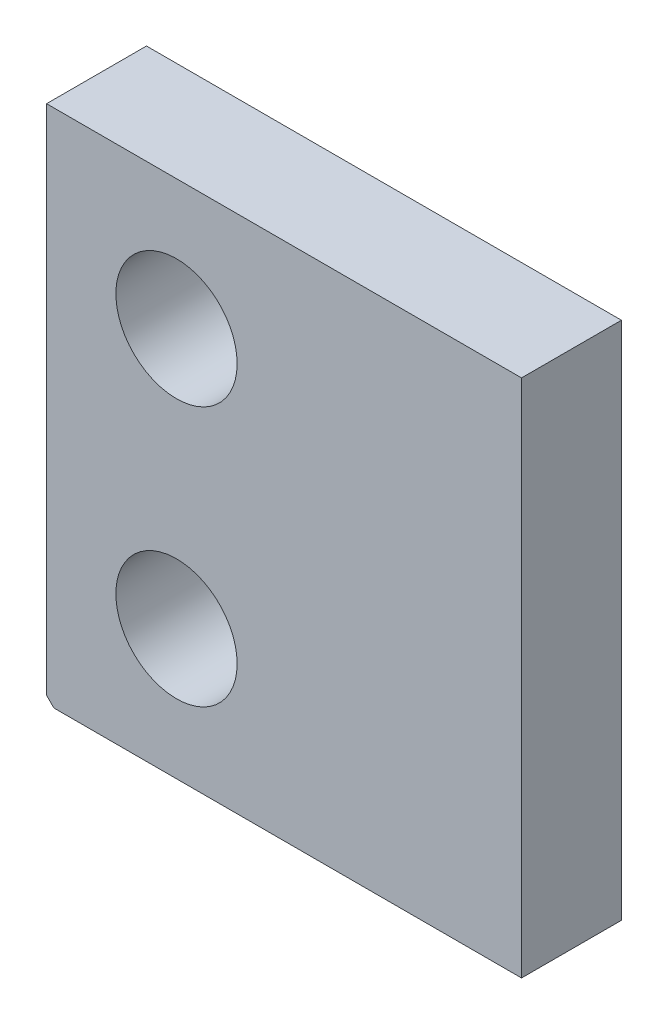
ISO-10303-21;
HEADER;
FILE_DESCRIPTION(('STEP AP214'),'2;1');
FILE_NAME('part.step','',(''),(''),'','','');
FILE_SCHEMA(('AUTOMOTIVE_DESIGN { 1 0 10303 214 1 1 1 1 }'));
ENDSEC;
DATA;
#1=APPLICATION_CONTEXT('core data for automotive mechanical design processes');
#2=APPLICATION_PROTOCOL_DEFINITION('international standard','automotive_design',2000,#1);
#3=PRODUCT_CONTEXT('',#1,'mechanical');
#4=PRODUCT('Part','Part','',(#3));
#5=PRODUCT_RELATED_PRODUCT_CATEGORY('part','',(#4));
#6=PRODUCT_DEFINITION_FORMATION('','',#4);
#7=PRODUCT_DEFINITION_CONTEXT('part definition',#1,'design');
#8=PRODUCT_DEFINITION('design','',#6,#7);
#9=PRODUCT_DEFINITION_SHAPE('','',#8);
#10=(LENGTH_UNIT() NAMED_UNIT(*) SI_UNIT(.MILLI.,.METRE.));
#11=(NAMED_UNIT(*) PLANE_ANGLE_UNIT() SI_UNIT($,.RADIAN.));
#12=(NAMED_UNIT(*) SI_UNIT($,.STERADIAN.) SOLID_ANGLE_UNIT());
#13=UNCERTAINTY_MEASURE_WITH_UNIT(LENGTH_MEASURE(1.E-05),#10,'distance_accuracy_value','');
#14=(GEOMETRIC_REPRESENTATION_CONTEXT(3) GLOBAL_UNCERTAINTY_ASSIGNED_CONTEXT((#13)) GLOBAL_UNIT_ASSIGNED_CONTEXT((#10,
#11,#12)) REPRESENTATION_CONTEXT('',''));
#15=CARTESIAN_POINT('',(0.,0.,0.));
#16=DIRECTION('',(0.,0.,1.));
#17=DIRECTION('',(1.,0.,0.));
#18=AXIS2_PLACEMENT_3D('',#15,#16,#17);
#19=CARTESIAN_POINT('',(16.45,-18.,6.92));
#20=DIRECTION('',(-1.,0.,0.));
#21=DIRECTION('',(0.,0.,1.));
#22=AXIS2_PLACEMENT_3D('',#19,#20,#21);
#23=PLANE('',#22);
#24=DIRECTION('',(0.,1.,0.));
#25=VECTOR('',#24,1.);
#26=CARTESIAN_POINT('',(16.45,-18.,0.));
#27=LINE('',#26,#25);
#28=CARTESIAN_POINT('',(16.45,-18.,0.));
#29=VERTEX_POINT('',#28);
#30=CARTESIAN_POINT('',(16.45,18.,0.));
#31=VERTEX_POINT('',#30);
#32=EDGE_CURVE('E104',#29,#31,#27,.T.);
#33=ORIENTED_EDGE('',*,*,#32,.T.);
#34=DIRECTION('',(0.,0.,-1.));
#35=VECTOR('',#34,1.);
#36=CARTESIAN_POINT('',(16.45,18.,6.92));
#37=LINE('',#36,#35);
#38=CARTESIAN_POINT('',(16.45,18.,6.92));
#39=VERTEX_POINT('',#38);
#40=EDGE_CURVE('E86',#39,#31,#37,.T.);
#41=ORIENTED_EDGE('',*,*,#40,.F.);
#42=DIRECTION('',(0.,1.,0.));
#43=VECTOR('',#42,1.);
#44=CARTESIAN_POINT('',(16.45,-18.,6.92));
#45=LINE('',#44,#43);
#46=CARTESIAN_POINT('',(16.45,-18.,6.92));
#47=VERTEX_POINT('',#46);
#48=EDGE_CURVE('E92',#47,#39,#45,.T.);
#49=ORIENTED_EDGE('',*,*,#48,.F.);
#50=DIRECTION('',(0.,0.,-1.));
#51=VECTOR('',#50,1.);
#52=CARTESIAN_POINT('',(16.45,-18.,6.92));
#53=LINE('',#52,#51);
#54=EDGE_CURVE('E109',#47,#29,#53,.T.);
#55=ORIENTED_EDGE('',*,*,#54,.T.);
#56=EDGE_LOOP('',(#33,#41,#49,#55));
#57=FACE_BOUND('',#56,.T.);
#58=ADVANCED_FACE('F35',(#57),#23,.F.);
#59=CARTESIAN_POINT('',(-16.45,18.,6.92));
#60=DIRECTION('',(0.,-1.,0.));
#61=DIRECTION('',(0.,0.,-1.));
#62=AXIS2_PLACEMENT_3D('',#59,#60,#61);
#63=PLANE('',#62);
#64=DIRECTION('',(-1.,0.,0.));
#65=VECTOR('',#64,1.);
#66=CARTESIAN_POINT('',(-16.45,18.,0.));
#67=LINE('',#66,#65);
#68=CARTESIAN_POINT('',(-16.45,18.,0.));
#69=VERTEX_POINT('',#68);
#70=EDGE_CURVE('E117',#31,#69,#67,.T.);
#71=ORIENTED_EDGE('',*,*,#70,.T.);
#72=DIRECTION('',(0.,0.,-1.));
#73=VECTOR('',#72,1.);
#74=CARTESIAN_POINT('',(-16.45,18.,6.92));
#75=LINE('',#74,#73);
#76=CARTESIAN_POINT('',(-16.45,18.,6.92));
#77=VERTEX_POINT('',#76);
#78=EDGE_CURVE('E89',#77,#69,#75,.T.);
#79=ORIENTED_EDGE('',*,*,#78,.F.);
#80=DIRECTION('',(-1.,0.,0.));
#81=VECTOR('',#80,1.);
#82=CARTESIAN_POINT('',(-16.45,18.,6.92));
#83=LINE('',#82,#81);
#84=EDGE_CURVE('E82',#39,#77,#83,.T.);
#85=ORIENTED_EDGE('',*,*,#84,.F.);
#86=ORIENTED_EDGE('',*,*,#40,.T.);
#87=EDGE_LOOP('',(#71,#79,#85,#86));
#88=FACE_BOUND('',#87,.T.);
#89=ADVANCED_FACE('F84',(#88),#63,.F.);
#90=CARTESIAN_POINT('',(-16.45,-18.,6.92));
#91=DIRECTION('',(1.,0.,0.));
#92=DIRECTION('',(0.,0.,-1.));
#93=AXIS2_PLACEMENT_3D('',#90,#91,#92);
#94=PLANE('',#93);
#95=DIRECTION('',(0.,-1.,0.));
#96=VECTOR('',#95,1.);
#97=CARTESIAN_POINT('',(-16.45,-18.,0.));
#98=LINE('',#97,#96);
#99=CARTESIAN_POINT('',(-16.45,-17.492,0.));
#100=VERTEX_POINT('',#99);
#101=EDGE_CURVE('E115',#69,#100,#98,.T.);
#102=ORIENTED_EDGE('',*,*,#101,.T.);
#103=DIRECTION('',(0.,0.,1.));
#104=VECTOR('',#103,1.);
#105=CARTESIAN_POINT('',(-16.45,-17.492,6.92));
#106=LINE('',#105,#104);
#107=CARTESIAN_POINT('',(-16.45,-17.492,6.92));
#108=VERTEX_POINT('',#107);
#109=EDGE_CURVE('E43',#100,#108,#106,.T.);
#110=ORIENTED_EDGE('',*,*,#109,.T.);
#111=DIRECTION('',(0.,-1.,0.));
#112=VECTOR('',#111,1.);
#113=CARTESIAN_POINT('',(-16.45,-18.,6.92));
#114=LINE('',#113,#112);
#115=EDGE_CURVE('E91',#77,#108,#114,.T.);
#116=ORIENTED_EDGE('',*,*,#115,.F.);
#117=ORIENTED_EDGE('',*,*,#78,.T.);
#118=EDGE_LOOP('',(#102,#110,#116,#117));
#119=FACE_BOUND('',#118,.T.);
#120=ADVANCED_FACE('F163',(#119),#94,.F.);
#121=CARTESIAN_POINT('',(-16.45,-18.,6.92));
#122=DIRECTION('',(0.,1.,0.));
#123=DIRECTION('',(0.,0.,1.));
#124=AXIS2_PLACEMENT_3D('',#121,#122,#123);
#125=PLANE('',#124);
#126=DIRECTION('',(1.,0.,0.));
#127=VECTOR('',#126,1.);
#128=CARTESIAN_POINT('',(-16.45,-18.,6.92));
#129=LINE('',#128,#127);
#130=CARTESIAN_POINT('',(-15.942,-18.,6.92));
#131=VERTEX_POINT('',#130);
#132=EDGE_CURVE('E97',#131,#47,#129,.T.);
#133=ORIENTED_EDGE('',*,*,#132,.F.);
#134=DIRECTION('',(0.,0.,-1.));
#135=VECTOR('',#134,1.);
#136=CARTESIAN_POINT('',(-15.942,-18.,6.92));
#137=LINE('',#136,#135);
#138=CARTESIAN_POINT('',(-15.942,-18.,0.));
#139=VERTEX_POINT('',#138);
#140=EDGE_CURVE('E105',#131,#139,#137,.T.);
#141=ORIENTED_EDGE('',*,*,#140,.T.);
#142=DIRECTION('',(1.,0.,0.));
#143=VECTOR('',#142,1.);
#144=CARTESIAN_POINT('',(-16.45,-18.,0.));
#145=LINE('',#144,#143);
#146=EDGE_CURVE('E101',#139,#29,#145,.T.);
#147=ORIENTED_EDGE('',*,*,#146,.T.);
#148=ORIENTED_EDGE('',*,*,#54,.F.);
#149=EDGE_LOOP('',(#133,#141,#147,#148));
#150=FACE_BOUND('',#149,.T.);
#151=ADVANCED_FACE('F140',(#150),#125,.F.);
#152=CARTESIAN_POINT('',(0.,0.,6.92));
#153=DIRECTION('',(0.,0.,-1.));
#154=DIRECTION('',(-1.,0.,0.));
#155=AXIS2_PLACEMENT_3D('',#152,#153,#154);
#156=PLANE('',#155);
#157=CARTESIAN_POINT('',(-7.44999998700001,-9.,6.92));
#158=DIRECTION('',(0.,0.,1.));
#159=DIRECTION('',(1.,0.,0.));
#160=AXIS2_PLACEMENT_3D('',#157,#158,#159);
#161=CIRCLE('',#160,4.2);
#162=CARTESIAN_POINT('',(-3.24999998700001,-9.,6.92));
#163=VERTEX_POINT('',#162);
#164=EDGE_CURVE('E131',#163,#163,#161,.T.);
#165=ORIENTED_EDGE('',*,*,#164,.F.);
#166=EDGE_LOOP('',(#165));
#167=FACE_BOUND('',#166,.T.);
#168=CARTESIAN_POINT('',(-7.44999998700001,9.,6.92));
#169=DIRECTION('',(0.,0.,1.));
#170=DIRECTION('',(1.,0.,0.));
#171=AXIS2_PLACEMENT_3D('',#168,#169,#170);
#172=CIRCLE('',#171,4.2);
#173=CARTESIAN_POINT('',(-3.24999998700001,9.,6.92));
#174=VERTEX_POINT('',#173);
#175=EDGE_CURVE('E125',#174,#174,#172,.T.);
#176=ORIENTED_EDGE('',*,*,#175,.F.);
#177=EDGE_LOOP('',(#176));
#178=FACE_BOUND('',#177,.T.);
#179=ORIENTED_EDGE('',*,*,#115,.T.);
#180=DIRECTION('',(-0.707106781186543,0.707106781186552,0.));
#181=VECTOR('',#180,1.);
#182=CARTESIAN_POINT('',(-15.942,-18.,6.92));
#183=LINE('',#182,#181);
#184=EDGE_CURVE('E11',#108,#131,#183,.F.);
#185=ORIENTED_EDGE('',*,*,#184,.T.);
#186=ORIENTED_EDGE('',*,*,#132,.T.);
#187=ORIENTED_EDGE('',*,*,#48,.T.);
#188=ORIENTED_EDGE('',*,*,#84,.T.);
#189=EDGE_LOOP('',(#179,#185,#186,#187,#188));
#190=FACE_BOUND('',#189,.T.);
#191=ADVANCED_FACE('F95',(#167,#178,#190),#156,.F.);
#192=CARTESIAN_POINT('',(0.,0.,0.));
#193=DIRECTION('',(0.,0.,-1.));
#194=DIRECTION('',(-1.,0.,0.));
#195=AXIS2_PLACEMENT_3D('',#192,#193,#194);
#196=PLANE('',#195);
#197=CARTESIAN_POINT('',(-7.44999998700001,-9.,0.));
#198=DIRECTION('',(0.,0.,1.));
#199=DIRECTION('',(1.,0.,0.));
#200=AXIS2_PLACEMENT_3D('',#197,#198,#199);
#201=CIRCLE('',#200,4.2);
#202=CARTESIAN_POINT('',(-3.24999998700001,-9.,0.));
#203=VERTEX_POINT('',#202);
#204=EDGE_CURVE('E128',#203,#203,#201,.T.);
#205=ORIENTED_EDGE('',*,*,#204,.T.);
#206=EDGE_LOOP('',(#205));
#207=FACE_BOUND('',#206,.T.);
#208=CARTESIAN_POINT('',(-7.44999998700001,9.,0.));
#209=DIRECTION('',(0.,0.,1.));
#210=DIRECTION('',(1.,0.,0.));
#211=AXIS2_PLACEMENT_3D('',#208,#209,#210);
#212=CIRCLE('',#211,4.2);
#213=CARTESIAN_POINT('',(-3.24999998700001,9.,0.));
#214=VERTEX_POINT('',#213);
#215=EDGE_CURVE('E120',#214,#214,#212,.T.);
#216=ORIENTED_EDGE('',*,*,#215,.T.);
#217=EDGE_LOOP('',(#216));
#218=FACE_BOUND('',#217,.T.);
#219=ORIENTED_EDGE('',*,*,#146,.F.);
#220=DIRECTION('',(0.707106781186543,-0.707106781186552,0.));
#221=VECTOR('',#220,1.);
#222=CARTESIAN_POINT('',(-16.9710000000001,-16.9709999999999,0.));
#223=LINE('',#222,#221);
#224=EDGE_CURVE('E57',#139,#100,#223,.F.);
#225=ORIENTED_EDGE('',*,*,#224,.T.);
#226=ORIENTED_EDGE('',*,*,#101,.F.);
#227=ORIENTED_EDGE('',*,*,#70,.F.);
#228=ORIENTED_EDGE('',*,*,#32,.F.);
#229=EDGE_LOOP('',(#219,#225,#226,#227,#228));
#230=FACE_BOUND('',#229,.T.);
#231=ADVANCED_FACE('F139',(#207,#218,#230),#196,.T.);
#232=CARTESIAN_POINT('',(-7.44999998700001,9.,6.92));
#233=DIRECTION('',(0.,0.,1.));
#234=DIRECTION('',(1.,0.,0.));
#235=AXIS2_PLACEMENT_3D('',#232,#233,#234);
#236=CYLINDRICAL_SURFACE('',#235,4.2);
#237=ORIENTED_EDGE('',*,*,#215,.F.);
#238=EDGE_LOOP('',(#237));
#239=FACE_BOUND('',#238,.T.);
#240=ORIENTED_EDGE('',*,*,#175,.T.);
#241=EDGE_LOOP('',(#240));
#242=FACE_BOUND('',#241,.T.);
#243=ADVANCED_FACE('F144',(#239,#242),#236,.F.);
#244=CARTESIAN_POINT('',(-7.44999998700001,-9.,6.92));
#245=DIRECTION('',(0.,0.,1.));
#246=DIRECTION('',(1.,0.,0.));
#247=AXIS2_PLACEMENT_3D('',#244,#245,#246);
#248=CYLINDRICAL_SURFACE('',#247,4.2);
#249=ORIENTED_EDGE('',*,*,#204,.F.);
#250=EDGE_LOOP('',(#249));
#251=FACE_BOUND('',#250,.T.);
#252=ORIENTED_EDGE('',*,*,#164,.T.);
#253=EDGE_LOOP('',(#252));
#254=FACE_BOUND('',#253,.T.);
#255=ADVANCED_FACE('F135',(#251,#254),#248,.F.);
#256=CARTESIAN_POINT('',(-15.942,-18.,6.92));
#257=DIRECTION('',(0.707106781186552,0.707106781186543,0.));
#258=DIRECTION('',(0.,0.,-1.));
#259=AXIS2_PLACEMENT_3D('',#256,#257,#258);
#260=PLANE('',#259);
#261=ORIENTED_EDGE('',*,*,#184,.F.);
#262=ORIENTED_EDGE('',*,*,#109,.F.);
#263=ORIENTED_EDGE('',*,*,#224,.F.);
#264=ORIENTED_EDGE('',*,*,#140,.F.);
#265=EDGE_LOOP('',(#261,#262,#263,#264));
#266=FACE_BOUND('',#265,.T.);
#267=ADVANCED_FACE('F37',(#266),#260,.F.);
#268=CLOSED_SHELL('',(#58,#89,#120,#151,#191,#231,#243,#255,#267));
#269=MANIFOLD_SOLID_BREP('B2',#268);
#270=ADVANCED_BREP_SHAPE_REPRESENTATION('',(#18,#269),#14);
#271=SHAPE_DEFINITION_REPRESENTATION(#9,#270);
ENDSEC;
END-ISO-10303-21;
